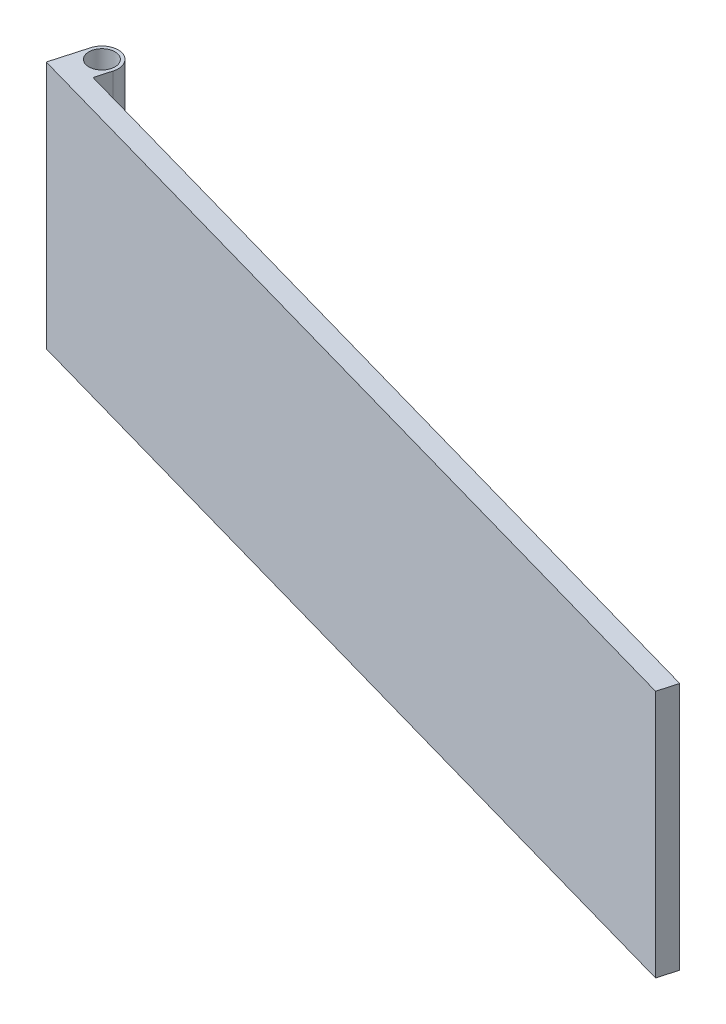
ISO-10303-21;
HEADER;
FILE_DESCRIPTION(('STEP AP214'),'2;1');
FILE_NAME('part.step','',(''),(''),'','','');
FILE_SCHEMA(('AUTOMOTIVE_DESIGN { 1 0 10303 214 1 1 1 1 }'));
ENDSEC;
DATA;
#1=APPLICATION_CONTEXT('core data for automotive mechanical design processes');
#2=APPLICATION_PROTOCOL_DEFINITION('international standard','automotive_design',2000,#1);
#3=PRODUCT_CONTEXT('',#1,'mechanical');
#4=PRODUCT('Part','Part','',(#3));
#5=PRODUCT_RELATED_PRODUCT_CATEGORY('part','',(#4));
#6=PRODUCT_DEFINITION_FORMATION('','',#4);
#7=PRODUCT_DEFINITION_CONTEXT('part definition',#1,'design');
#8=PRODUCT_DEFINITION('design','',#6,#7);
#9=PRODUCT_DEFINITION_SHAPE('','',#8);
#10=(LENGTH_UNIT() NAMED_UNIT(*) SI_UNIT(.MILLI.,.METRE.));
#11=(NAMED_UNIT(*) PLANE_ANGLE_UNIT() SI_UNIT($,.RADIAN.));
#12=(NAMED_UNIT(*) SI_UNIT($,.STERADIAN.) SOLID_ANGLE_UNIT());
#13=UNCERTAINTY_MEASURE_WITH_UNIT(LENGTH_MEASURE(1.E-05),#10,'distance_accuracy_value','');
#14=(GEOMETRIC_REPRESENTATION_CONTEXT(3) GLOBAL_UNCERTAINTY_ASSIGNED_CONTEXT((#13)) GLOBAL_UNIT_ASSIGNED_CONTEXT((#10,
#11,#12)) REPRESENTATION_CONTEXT('',''));
#15=CARTESIAN_POINT('',(0.,0.,0.));
#16=DIRECTION('',(0.,0.,1.));
#17=DIRECTION('',(1.,0.,0.));
#18=AXIS2_PLACEMENT_3D('',#15,#16,#17);
#19=CARTESIAN_POINT('',(-5.60113821836263,1.9,6.11628696544364));
#20=DIRECTION('',(0.962248672431212,0.,0.27217180677721));
#21=DIRECTION('',(0.27217180677721,0.,-0.962248672431212));
#22=AXIS2_PLACEMENT_3D('',#19,#20,#21);
#23=PLANE('',#22);
#24=DIRECTION('',(0.,1.,0.));
#25=VECTOR('',#24,1.);
#26=CARTESIAN_POINT('',(-5.73722412175123,0.,6.59741130165925));
#27=LINE('',#26,#25);
#28=CARTESIAN_POINT('',(-5.73722412175123,-1.9,6.59741130165924));
#29=VERTEX_POINT('',#28);
#30=CARTESIAN_POINT('',(-5.73722412175123,1.9,6.59741130165925));
#31=VERTEX_POINT('',#30);
#32=EDGE_CURVE('E82',#29,#31,#27,.T.);
#33=ORIENTED_EDGE('',*,*,#32,.F.);
#34=DIRECTION('',(0.27217180677721,0.,-0.962248672431212));
#35=VECTOR('',#34,1.);
#36=CARTESIAN_POINT('',(-5.60113821836263,-1.9,6.11628696544364));
#37=LINE('',#36,#35);
#38=CARTESIAN_POINT('',(-5.66918117005693,-1.9,6.35684913355144));
#39=VERTEX_POINT('',#38);
#40=EDGE_CURVE('E69',#29,#39,#37,.T.);
#41=ORIENTED_EDGE('',*,*,#40,.T.);
#42=DIRECTION('',(0.,-1.,0.));
#43=VECTOR('',#42,1.);
#44=CARTESIAN_POINT('',(-5.66918117005693,1.9,6.35684913355144));
#45=LINE('',#44,#43);
#46=CARTESIAN_POINT('',(-5.66918117005693,1.9,6.35684913355144));
#47=VERTEX_POINT('',#46);
#48=EDGE_CURVE('E79',#47,#39,#45,.T.);
#49=ORIENTED_EDGE('',*,*,#48,.F.);
#50=DIRECTION('',(0.27217180677721,0.,-0.962248672431212));
#51=VECTOR('',#50,1.);
#52=CARTESIAN_POINT('',(-5.60113821836263,1.9,6.11628696544364));
#53=LINE('',#52,#51);
#54=EDGE_CURVE('E84',#47,#31,#53,.F.);
#55=ORIENTED_EDGE('',*,*,#54,.T.);
#56=EDGE_LOOP('',(#33,#41,#49,#55));
#57=FACE_BOUND('',#56,.T.);
#58=ADVANCED_FACE('F16',(#57),#23,.T.);
#59=CARTESIAN_POINT('',(-5.90974333816473,1.9,6.28880618185714));
#60=DIRECTION('',(0.,-1.,0.));
#61=DIRECTION('',(0.,0.,-1.));
#62=AXIS2_PLACEMENT_3D('',#59,#60,#61);
#63=CYLINDRICAL_SURFACE('',#62,0.25);
#64=CARTESIAN_POINT('',(-5.90974333816473,1.9,6.28880618185714));
#65=DIRECTION('',(0.,-1.,0.));
#66=DIRECTION('',(0.,0.,-1.));
#67=AXIS2_PLACEMENT_3D('',#64,#65,#66);
#68=CIRCLE('',#67,0.25);
#69=CARTESIAN_POINT('',(-6.15030550627254,1.9,6.22076323016284));
#70=VERTEX_POINT('',#69);
#71=EDGE_CURVE('E76',#70,#47,#68,.T.);
#72=ORIENTED_EDGE('',*,*,#71,.T.);
#73=ORIENTED_EDGE('',*,*,#48,.T.);
#74=CARTESIAN_POINT('',(-5.90974333816473,-1.9,6.28880618185714));
#75=DIRECTION('',(0.,-1.,0.));
#76=DIRECTION('',(0.,0.,-1.));
#77=AXIS2_PLACEMENT_3D('',#74,#75,#76);
#78=CIRCLE('',#77,0.25);
#79=CARTESIAN_POINT('',(-6.15030550627254,-1.9,6.22076323016284));
#80=VERTEX_POINT('',#79);
#81=EDGE_CURVE('E19',#39,#80,#78,.F.);
#82=ORIENTED_EDGE('',*,*,#81,.T.);
#83=DIRECTION('',(0.,1.,0.));
#84=VECTOR('',#83,1.);
#85=CARTESIAN_POINT('',(-6.15030550627253,-1.9,6.22076323016283));
#86=LINE('',#85,#84);
#87=EDGE_CURVE('E88',#70,#80,#86,.F.);
#88=ORIENTED_EDGE('',*,*,#87,.F.);
#89=EDGE_LOOP('',(#72,#73,#82,#88));
#90=FACE_BOUND('',#89,.T.);
#91=ADVANCED_FACE('F86',(#90),#63,.T.);
#92=CARTESIAN_POINT('',(0.281651542033163,0.,8.29984884313238));
#93=DIRECTION('',(0.27217180677721,0.,-0.962248672431212));
#94=DIRECTION('',(-0.962248672431212,0.,-0.27217180677721));
#95=AXIS2_PLACEMENT_3D('',#92,#93,#94);
#96=PLANE('',#95);
#97=DIRECTION('',(0.,1.,0.));
#98=VECTOR('',#97,1.);
#99=CARTESIAN_POINT('',(6.78165154203317,1.9,10.1383722879941));
#100=LINE('',#99,#98);
#101=CARTESIAN_POINT('',(6.78165154203317,-1.9,10.1383722879941));
#102=VERTEX_POINT('',#101);
#103=CARTESIAN_POINT('',(6.78165154203317,1.9,10.1383722879941));
#104=VERTEX_POINT('',#103);
#105=EDGE_CURVE('E120',#102,#104,#100,.T.);
#106=ORIENTED_EDGE('',*,*,#105,.F.);
#107=DIRECTION('',(0.962248672431212,0.,0.272171806777209));
#108=VECTOR('',#107,1.);
#109=CARTESIAN_POINT('',(-5.73722412175123,-1.9,6.59741130165924));
#110=LINE('',#109,#108);
#111=EDGE_CURVE('E101',#29,#102,#110,.T.);
#112=ORIENTED_EDGE('',*,*,#111,.F.);
#113=ORIENTED_EDGE('',*,*,#32,.T.);
#114=DIRECTION('',(-0.962248672431212,0.,-0.272171806777209));
#115=VECTOR('',#114,1.);
#116=CARTESIAN_POINT('',(6.78165154203317,1.9,10.1383722879941));
#117=LINE('',#116,#115);
#118=EDGE_CURVE('E105',#104,#31,#117,.T.);
#119=ORIENTED_EDGE('',*,*,#118,.F.);
#120=EDGE_LOOP('',(#106,#112,#113,#119));
#121=FACE_BOUND('',#120,.T.);
#122=ADVANCED_FACE('F148',(#121),#96,.T.);
#123=CARTESIAN_POINT('',(-5.90974333816473,1.9,6.28880618185714));
#124=DIRECTION('',(0.,-1.,0.));
#125=DIRECTION('',(0.,0.,-1.));
#126=AXIS2_PLACEMENT_3D('',#123,#124,#125);
#127=CYLINDRICAL_SURFACE('',#126,0.2);
#128=CARTESIAN_POINT('',(-5.90974333816473,-1.9,6.28880618185714));
#129=DIRECTION('',(0.,-1.,0.));
#130=DIRECTION('',(0.,0.,-1.));
#131=AXIS2_PLACEMENT_3D('',#128,#129,#130);
#132=CIRCLE('',#131,0.2);
#133=CARTESIAN_POINT('',(-5.90974333816473,-1.9,6.08880618185714));
#134=VERTEX_POINT('',#133);
#135=EDGE_CURVE('E114',#134,#134,#132,.F.);
#136=ORIENTED_EDGE('',*,*,#135,.F.);
#137=EDGE_LOOP('',(#136));
#138=FACE_BOUND('',#137,.T.);
#139=CARTESIAN_POINT('',(-5.90974333816473,1.9,6.28880618185714));
#140=DIRECTION('',(0.,-1.,0.));
#141=DIRECTION('',(0.,0.,-1.));
#142=AXIS2_PLACEMENT_3D('',#139,#140,#141);
#143=CIRCLE('',#142,0.2);
#144=CARTESIAN_POINT('',(-5.90974333816473,1.9,6.08880618185714));
#145=VERTEX_POINT('',#144);
#146=EDGE_CURVE('E108',#145,#145,#143,.T.);
#147=ORIENTED_EDGE('',*,*,#146,.F.);
#148=EDGE_LOOP('',(#147));
#149=FACE_BOUND('',#148,.T.);
#150=ADVANCED_FACE('F156',(#138,#149),#127,.F.);
#151=CARTESIAN_POINT('',(-6.3,-1.9,6.75));
#152=DIRECTION('',(-0.962248672431212,0.,-0.27217180677721));
#153=DIRECTION('',(-0.27217180677721,0.,0.962248672431212));
#154=AXIS2_PLACEMENT_3D('',#151,#152,#153);
#155=PLANE('',#154);
#156=DIRECTION('',(0.,1.,0.));
#157=VECTOR('',#156,1.);
#158=CARTESIAN_POINT('',(-6.3,0.,6.75));
#159=LINE('',#158,#157);
#160=CARTESIAN_POINT('',(-6.3,1.9,6.75));
#161=VERTEX_POINT('',#160);
#162=CARTESIAN_POINT('',(-6.3,-1.9,6.75));
#163=VERTEX_POINT('',#162);
#164=EDGE_CURVE('E113',#161,#163,#159,.F.);
#165=ORIENTED_EDGE('',*,*,#164,.F.);
#166=DIRECTION('',(-0.2721718067772,0.,0.962248672431214));
#167=VECTOR('',#166,1.);
#168=CARTESIAN_POINT('',(-6.15030550627254,1.9,6.22076323016283));
#169=LINE('',#168,#167);
#170=EDGE_CURVE('E140',#70,#161,#169,.T.);
#171=ORIENTED_EDGE('',*,*,#170,.F.);
#172=ORIENTED_EDGE('',*,*,#87,.T.);
#173=DIRECTION('',(0.2721718067772,0.,-0.962248672431214));
#174=VECTOR('',#173,1.);
#175=CARTESIAN_POINT('',(-6.3,-1.9,6.75));
#176=LINE('',#175,#174);
#177=EDGE_CURVE('E71',#163,#80,#176,.T.);
#178=ORIENTED_EDGE('',*,*,#177,.F.);
#179=EDGE_LOOP('',(#165,#171,#172,#178));
#180=FACE_BOUND('',#179,.T.);
#181=ADVANCED_FACE('F154',(#180),#155,.T.);
#182=CARTESIAN_POINT('',(6.7,-1.9,10.4270468897235));
#183=DIRECTION('',(0.,-1.,0.));
#184=DIRECTION('',(1.,0.,0.));
#185=AXIS2_PLACEMENT_3D('',#182,#183,#184);
#186=PLANE('',#185);
#187=ORIENTED_EDGE('',*,*,#135,.T.);
#188=EDGE_LOOP('',(#187));
#189=FACE_BOUND('',#188,.T.);
#190=DIRECTION('',(0.962248672431212,0.,0.27217180677721));
#191=VECTOR('',#190,1.);
#192=CARTESIAN_POINT('',(0.199999999999999,-1.9,8.58852344486174));
#193=LINE('',#192,#191);
#194=CARTESIAN_POINT('',(6.7,-1.9,10.4270468897235));
#195=VERTEX_POINT('',#194);
#196=EDGE_CURVE('E130',#163,#195,#193,.T.);
#197=ORIENTED_EDGE('',*,*,#196,.F.);
#198=ORIENTED_EDGE('',*,*,#177,.T.);
#199=ORIENTED_EDGE('',*,*,#81,.F.);
#200=ORIENTED_EDGE('',*,*,#40,.F.);
#201=ORIENTED_EDGE('',*,*,#111,.T.);
#202=DIRECTION('',(0.27217180677721,0.,-0.962248672431212));
#203=VECTOR('',#202,1.);
#204=CARTESIAN_POINT('',(6.7,-1.9,10.4270468897235));
#205=LINE('',#204,#203);
#206=EDGE_CURVE('E116',#195,#102,#205,.T.);
#207=ORIENTED_EDGE('',*,*,#206,.F.);
#208=EDGE_LOOP('',(#197,#198,#199,#200,#201,#207));
#209=FACE_BOUND('',#208,.T.);
#210=ADVANCED_FACE('F68',(#189,#209),#186,.T.);
#211=CARTESIAN_POINT('',(6.7,1.9,10.4270468897235));
#212=DIRECTION('',(0.962248672431212,0.,0.27217180677721));
#213=DIRECTION('',(0.27217180677721,0.,-0.962248672431212));
#214=AXIS2_PLACEMENT_3D('',#211,#212,#213);
#215=PLANE('',#214);
#216=ORIENTED_EDGE('',*,*,#105,.T.);
#217=DIRECTION('',(0.272171806777202,0.,-0.962248672431214));
#218=VECTOR('',#217,1.);
#219=CARTESIAN_POINT('',(6.7,1.9,10.4270468897235));
#220=LINE('',#219,#218);
#221=CARTESIAN_POINT('',(6.7,1.9,10.4270468897235));
#222=VERTEX_POINT('',#221);
#223=EDGE_CURVE('E34',#222,#104,#220,.T.);
#224=ORIENTED_EDGE('',*,*,#223,.F.);
#225=DIRECTION('',(0.,1.,0.));
#226=VECTOR('',#225,1.);
#227=CARTESIAN_POINT('',(6.70000000000001,0.,10.4270468897235));
#228=LINE('',#227,#226);
#229=EDGE_CURVE('E25',#195,#222,#228,.T.);
#230=ORIENTED_EDGE('',*,*,#229,.F.);
#231=ORIENTED_EDGE('',*,*,#206,.T.);
#232=EDGE_LOOP('',(#216,#224,#230,#231));
#233=FACE_BOUND('',#232,.T.);
#234=ADVANCED_FACE('F146',(#233),#215,.T.);
#235=CARTESIAN_POINT('',(-6.3,1.9,6.75));
#236=DIRECTION('',(0.,1.,0.));
#237=DIRECTION('',(-1.,0.,0.));
#238=AXIS2_PLACEMENT_3D('',#235,#236,#237);
#239=PLANE('',#238);
#240=ORIENTED_EDGE('',*,*,#146,.T.);
#241=EDGE_LOOP('',(#240));
#242=FACE_BOUND('',#241,.T.);
#243=ORIENTED_EDGE('',*,*,#118,.T.);
#244=ORIENTED_EDGE('',*,*,#54,.F.);
#245=ORIENTED_EDGE('',*,*,#71,.F.);
#246=ORIENTED_EDGE('',*,*,#170,.T.);
#247=DIRECTION('',(0.962248672431212,0.,0.27217180677721));
#248=VECTOR('',#247,1.);
#249=CARTESIAN_POINT('',(0.199999999999999,1.9,8.58852344486174));
#250=LINE('',#249,#248);
#251=EDGE_CURVE('E11',#222,#161,#250,.F.);
#252=ORIENTED_EDGE('',*,*,#251,.F.);
#253=ORIENTED_EDGE('',*,*,#223,.T.);
#254=EDGE_LOOP('',(#243,#244,#245,#246,#252,#253));
#255=FACE_BOUND('',#254,.T.);
#256=ADVANCED_FACE('F150',(#242,#255),#239,.T.);
#257=CARTESIAN_POINT('',(0.199999999999999,0.,8.58852344486174));
#258=DIRECTION('',(-0.27217180677721,0.,0.962248672431212));
#259=DIRECTION('',(0.962248672431212,0.,0.27217180677721));
#260=AXIS2_PLACEMENT_3D('',#257,#258,#259);
#261=PLANE('',#260);
#262=ORIENTED_EDGE('',*,*,#229,.T.);
#263=ORIENTED_EDGE('',*,*,#251,.T.);
#264=ORIENTED_EDGE('',*,*,#164,.T.);
#265=ORIENTED_EDGE('',*,*,#196,.T.);
#266=EDGE_LOOP('',(#262,#263,#264,#265));
#267=FACE_BOUND('',#266,.T.);
#268=ADVANCED_FACE('F152',(#267),#261,.T.);
#269=CLOSED_SHELL('',(#58,#91,#122,#150,#181,#210,#234,#256,#268));
#270=MANIFOLD_SOLID_BREP('B1',#269);
#271=ADVANCED_BREP_SHAPE_REPRESENTATION('',(#18,#270),#14);
#272=SHAPE_DEFINITION_REPRESENTATION(#9,#271);
ENDSEC;
END-ISO-10303-21;
